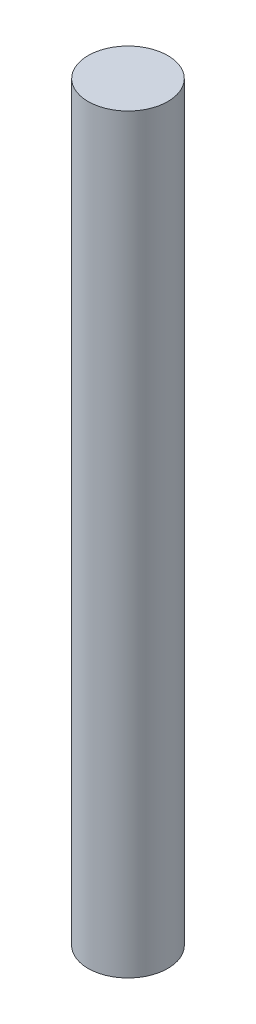
ISO-10303-21;
HEADER;
FILE_DESCRIPTION(('STEP AP214'),'2;1');
FILE_NAME('part.step','',(''),(''),'','','');
FILE_SCHEMA(('AUTOMOTIVE_DESIGN { 1 0 10303 214 1 1 1 1 }'));
ENDSEC;
DATA;
#1=APPLICATION_CONTEXT('core data for automotive mechanical design processes');
#2=APPLICATION_PROTOCOL_DEFINITION('international standard','automotive_design',2000,#1);
#3=PRODUCT_CONTEXT('',#1,'mechanical');
#4=PRODUCT('Part','Part','',(#3));
#5=PRODUCT_RELATED_PRODUCT_CATEGORY('part','',(#4));
#6=PRODUCT_DEFINITION_FORMATION('','',#4);
#7=PRODUCT_DEFINITION_CONTEXT('part definition',#1,'design');
#8=PRODUCT_DEFINITION('design','',#6,#7);
#9=PRODUCT_DEFINITION_SHAPE('','',#8);
#10=(LENGTH_UNIT() NAMED_UNIT(*) SI_UNIT(.MILLI.,.METRE.));
#11=(NAMED_UNIT(*) PLANE_ANGLE_UNIT() SI_UNIT($,.RADIAN.));
#12=(NAMED_UNIT(*) SI_UNIT($,.STERADIAN.) SOLID_ANGLE_UNIT());
#13=UNCERTAINTY_MEASURE_WITH_UNIT(LENGTH_MEASURE(1.E-05),#10,'distance_accuracy_value','');
#14=(GEOMETRIC_REPRESENTATION_CONTEXT(3) GLOBAL_UNCERTAINTY_ASSIGNED_CONTEXT((#13)) GLOBAL_UNIT_ASSIGNED_CONTEXT((#10,
#11,#12)) REPRESENTATION_CONTEXT('',''));
#15=CARTESIAN_POINT('',(0.,0.,0.));
#16=DIRECTION('',(0.,0.,1.));
#17=DIRECTION('',(1.,0.,0.));
#18=AXIS2_PLACEMENT_3D('',#15,#16,#17);
#19=CARTESIAN_POINT('',(0.,28.27,0.));
#20=DIRECTION('',(0.,-1.,0.));
#21=DIRECTION('',(0.,0.,-1.));
#22=AXIS2_PLACEMENT_3D('',#19,#20,#21);
#23=CYLINDRICAL_SURFACE('',#22,1.5);
#24=CARTESIAN_POINT('',(0.,28.27,0.));
#25=DIRECTION('',(0.,1.,0.));
#26=DIRECTION('',(0.,0.,1.));
#27=AXIS2_PLACEMENT_3D('',#24,#25,#26);
#28=CIRCLE('',#27,1.5);
#29=CARTESIAN_POINT('',(0.,28.27,1.5));
#30=VERTEX_POINT('',#29);
#31=EDGE_CURVE('E10',#30,#30,#28,.T.);
#32=ORIENTED_EDGE('',*,*,#31,.F.);
#33=EDGE_LOOP('',(#32));
#34=FACE_BOUND('',#33,.T.);
#35=CARTESIAN_POINT('',(0.,0.,0.));
#36=DIRECTION('',(0.,1.,0.));
#37=DIRECTION('',(0.,0.,1.));
#38=AXIS2_PLACEMENT_3D('',#35,#36,#37);
#39=CIRCLE('',#38,1.5);
#40=CARTESIAN_POINT('',(0.,0.,1.5));
#41=VERTEX_POINT('',#40);
#42=EDGE_CURVE('E31',#41,#41,#39,.T.);
#43=ORIENTED_EDGE('',*,*,#42,.T.);
#44=EDGE_LOOP('',(#43));
#45=FACE_BOUND('',#44,.T.);
#46=ADVANCED_FACE('F28',(#34,#45),#23,.T.);
#47=CARTESIAN_POINT('',(0.,28.27,0.));
#48=DIRECTION('',(0.,1.,0.));
#49=DIRECTION('',(0.,0.,1.));
#50=AXIS2_PLACEMENT_3D('',#47,#48,#49);
#51=PLANE('',#50);
#52=ORIENTED_EDGE('',*,*,#31,.T.);
#53=EDGE_LOOP('',(#52));
#54=FACE_BOUND('',#53,.T.);
#55=ADVANCED_FACE('F43',(#54),#51,.T.);
#56=CARTESIAN_POINT('',(0.,0.,0.));
#57=DIRECTION('',(0.,1.,0.));
#58=DIRECTION('',(0.,0.,1.));
#59=AXIS2_PLACEMENT_3D('',#56,#57,#58);
#60=PLANE('',#59);
#61=ORIENTED_EDGE('',*,*,#42,.F.);
#62=EDGE_LOOP('',(#61));
#63=FACE_BOUND('',#62,.T.);
#64=ADVANCED_FACE('F41',(#63),#60,.F.);
#65=CLOSED_SHELL('',(#46,#55,#64));
#66=MANIFOLD_SOLID_BREP('B2',#65);
#67=ADVANCED_BREP_SHAPE_REPRESENTATION('',(#18,#66),#14);
#68=SHAPE_DEFINITION_REPRESENTATION(#9,#67);
ENDSEC;
END-ISO-10303-21;
